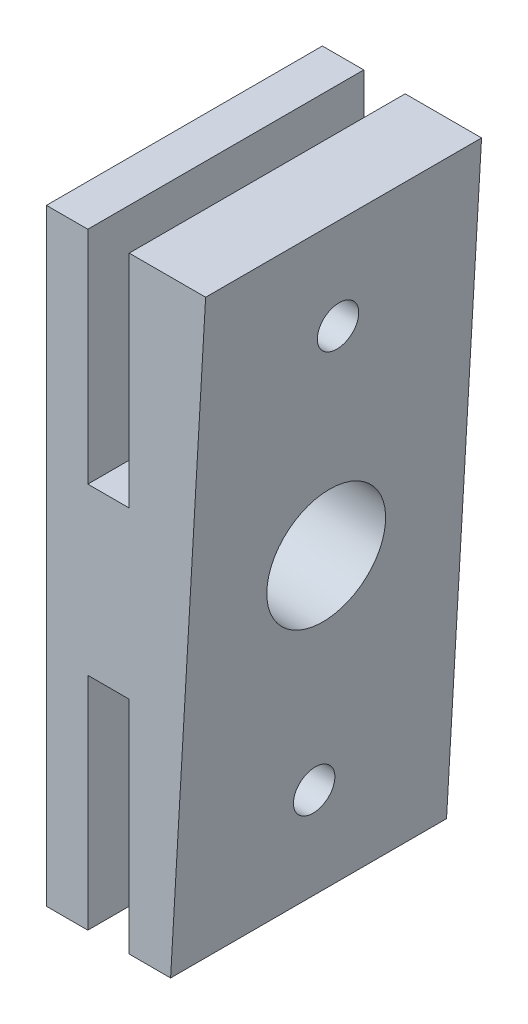
ISO-10303-21;
HEADER;
FILE_DESCRIPTION(('STEP AP214'),'2;1');
FILE_NAME('part.step','',(''),(''),'','','');
FILE_SCHEMA(('AUTOMOTIVE_DESIGN { 1 0 10303 214 1 1 1 1 }'));
ENDSEC;
DATA;
#1=APPLICATION_CONTEXT('core data for automotive mechanical design processes');
#2=APPLICATION_PROTOCOL_DEFINITION('international standard','automotive_design',2000,#1);
#3=PRODUCT_CONTEXT('',#1,'mechanical');
#4=PRODUCT('Part','Part','',(#3));
#5=PRODUCT_RELATED_PRODUCT_CATEGORY('part','',(#4));
#6=PRODUCT_DEFINITION_FORMATION('','',#4);
#7=PRODUCT_DEFINITION_CONTEXT('part definition',#1,'design');
#8=PRODUCT_DEFINITION('design','',#6,#7);
#9=PRODUCT_DEFINITION_SHAPE('','',#8);
#10=(LENGTH_UNIT() NAMED_UNIT(*) SI_UNIT(.MILLI.,.METRE.));
#11=(NAMED_UNIT(*) PLANE_ANGLE_UNIT() SI_UNIT($,.RADIAN.));
#12=(NAMED_UNIT(*) SI_UNIT($,.STERADIAN.) SOLID_ANGLE_UNIT());
#13=UNCERTAINTY_MEASURE_WITH_UNIT(LENGTH_MEASURE(1.E-05),#10,'distance_accuracy_value','');
#14=(GEOMETRIC_REPRESENTATION_CONTEXT(3) GLOBAL_UNCERTAINTY_ASSIGNED_CONTEXT((#13)) GLOBAL_UNIT_ASSIGNED_CONTEXT((#10,
#11,#12)) REPRESENTATION_CONTEXT('',''));
#15=CARTESIAN_POINT('',(0.,0.,0.));
#16=DIRECTION('',(0.,0.,1.));
#17=DIRECTION('',(1.,0.,0.));
#18=AXIS2_PLACEMENT_3D('',#15,#16,#17);
#19=CARTESIAN_POINT('',(3.,22.,20.));
#20=DIRECTION('',(0.,-1.,0.));
#21=DIRECTION('',(0.,0.,-1.));
#22=AXIS2_PLACEMENT_3D('',#19,#20,#21);
#23=PLANE('',#22);
#24=DIRECTION('',(-1.,0.,0.));
#25=VECTOR('',#24,1.);
#26=CARTESIAN_POINT('',(3.,22.,0.));
#27=LINE('',#26,#25);
#28=CARTESIAN_POINT('',(3.,22.,0.));
#29=VERTEX_POINT('',#28);
#30=CARTESIAN_POINT('',(0.,22.,0.));
#31=VERTEX_POINT('',#30);
#32=EDGE_CURVE('E155',#29,#31,#27,.T.);
#33=ORIENTED_EDGE('',*,*,#32,.T.);
#34=DIRECTION('',(0.,0.,-1.));
#35=VECTOR('',#34,1.);
#36=CARTESIAN_POINT('',(0.,22.,20.));
#37=LINE('',#36,#35);
#38=CARTESIAN_POINT('',(0.,22.,20.));
#39=VERTEX_POINT('',#38);
#40=EDGE_CURVE('E12',#39,#31,#37,.T.);
#41=ORIENTED_EDGE('',*,*,#40,.F.);
#42=DIRECTION('',(-1.,0.,0.));
#43=VECTOR('',#42,1.);
#44=CARTESIAN_POINT('',(3.,22.,20.));
#45=LINE('',#44,#43);
#46=CARTESIAN_POINT('',(3.,22.,20.));
#47=VERTEX_POINT('',#46);
#48=EDGE_CURVE('E177',#47,#39,#45,.T.);
#49=ORIENTED_EDGE('',*,*,#48,.F.);
#50=DIRECTION('',(0.,0.,-1.));
#51=VECTOR('',#50,1.);
#52=CARTESIAN_POINT('',(3.,22.,20.));
#53=LINE('',#52,#51);
#54=EDGE_CURVE('E151',#47,#29,#53,.T.);
#55=ORIENTED_EDGE('',*,*,#54,.T.);
#56=EDGE_LOOP('',(#33,#41,#49,#55));
#57=FACE_BOUND('',#56,.T.);
#58=ADVANCED_FACE('F36',(#57),#23,.F.);
#59=CARTESIAN_POINT('',(0.,22.,20.));
#60=DIRECTION('',(1.,0.,0.));
#61=DIRECTION('',(0.,0.,-1.));
#62=AXIS2_PLACEMENT_3D('',#59,#60,#61);
#63=PLANE('',#62);
#64=CARTESIAN_POINT('',(0.,0.749999999900975,10.));
#65=DIRECTION('',(1.,0.,0.));
#66=DIRECTION('',(0.,1.,0.));
#67=AXIS2_PLACEMENT_3D('',#64,#65,#66);
#68=ELLIPSE('',#67,4.30715012040991,4.3);
#69=CARTESIAN_POINT('',(0.,5.05715012031088,10.));
#70=VERTEX_POINT('',#69);
#71=EDGE_CURVE('E40',#70,#70,#68,.F.);
#72=ORIENTED_EDGE('',*,*,#71,.F.);
#73=EDGE_LOOP('',(#72));
#74=FACE_BOUND('',#73,.T.);
#75=CARTESIAN_POINT('',(0.,-15.,10.));
#76=DIRECTION('',(-1.,0.,0.));
#77=DIRECTION('',(0.,0.,1.));
#78=AXIS2_PLACEMENT_3D('',#75,#76,#77);
#79=CIRCLE('',#78,1.5);
#80=CARTESIAN_POINT('',(0.,-15.,11.5));
#81=VERTEX_POINT('',#80);
#82=EDGE_CURVE('E206',#81,#81,#79,.T.);
#83=ORIENTED_EDGE('',*,*,#82,.F.);
#84=EDGE_LOOP('',(#83));
#85=FACE_BOUND('',#84,.T.);
#86=CARTESIAN_POINT('',(0.,15.,10.));
#87=DIRECTION('',(-1.,0.,0.));
#88=DIRECTION('',(0.,0.,1.));
#89=AXIS2_PLACEMENT_3D('',#86,#87,#88);
#90=CIRCLE('',#89,1.5);
#91=CARTESIAN_POINT('',(0.,15.,11.5));
#92=VERTEX_POINT('',#91);
#93=EDGE_CURVE('E202',#92,#92,#90,.T.);
#94=ORIENTED_EDGE('',*,*,#93,.F.);
#95=EDGE_LOOP('',(#94));
#96=FACE_BOUND('',#95,.T.);
#97=DIRECTION('',(0.,-1.,0.));
#98=VECTOR('',#97,1.);
#99=CARTESIAN_POINT('',(0.,22.,0.));
#100=LINE('',#99,#98);
#101=CARTESIAN_POINT('',(0.,-22.,0.));
#102=VERTEX_POINT('',#101);
#103=EDGE_CURVE('E158',#31,#102,#100,.T.);
#104=ORIENTED_EDGE('',*,*,#103,.T.);
#105=DIRECTION('',(0.,0.,-1.));
#106=VECTOR('',#105,1.);
#107=CARTESIAN_POINT('',(0.,-22.,20.));
#108=LINE('',#107,#106);
#109=CARTESIAN_POINT('',(0.,-22.,20.));
#110=VERTEX_POINT('',#109);
#111=EDGE_CURVE('E46',#110,#102,#108,.T.);
#112=ORIENTED_EDGE('',*,*,#111,.F.);
#113=DIRECTION('',(0.,-1.,0.));
#114=VECTOR('',#113,1.);
#115=CARTESIAN_POINT('',(0.,22.,20.));
#116=LINE('',#115,#114);
#117=EDGE_CURVE('E105',#39,#110,#116,.T.);
#118=ORIENTED_EDGE('',*,*,#117,.F.);
#119=ORIENTED_EDGE('',*,*,#40,.T.);
#120=EDGE_LOOP('',(#104,#112,#118,#119));
#121=FACE_BOUND('',#120,.T.);
#122=ADVANCED_FACE('F217',(#74,#85,#96,#121),#63,.F.);
#123=CARTESIAN_POINT('',(0.,-22.,20.));
#124=DIRECTION('',(0.,1.,0.));
#125=DIRECTION('',(0.,0.,1.));
#126=AXIS2_PLACEMENT_3D('',#123,#124,#125);
#127=PLANE('',#126);
#128=DIRECTION('',(1.,0.,0.));
#129=VECTOR('',#128,1.);
#130=CARTESIAN_POINT('',(0.,-22.,0.));
#131=LINE('',#130,#129);
#132=CARTESIAN_POINT('',(3.,-22.,0.));
#133=VERTEX_POINT('',#132);
#134=EDGE_CURVE('E161',#102,#133,#131,.T.);
#135=ORIENTED_EDGE('',*,*,#134,.T.);
#136=DIRECTION('',(0.,0.,-1.));
#137=VECTOR('',#136,1.);
#138=CARTESIAN_POINT('',(3.,-22.,20.));
#139=LINE('',#138,#137);
#140=CARTESIAN_POINT('',(3.,-22.,20.));
#141=VERTEX_POINT('',#140);
#142=EDGE_CURVE('E193',#141,#133,#139,.T.);
#143=ORIENTED_EDGE('',*,*,#142,.F.);
#144=DIRECTION('',(1.,0.,0.));
#145=VECTOR('',#144,1.);
#146=CARTESIAN_POINT('',(0.,-22.,20.));
#147=LINE('',#146,#145);
#148=EDGE_CURVE('E233',#110,#141,#147,.T.);
#149=ORIENTED_EDGE('',*,*,#148,.F.);
#150=ORIENTED_EDGE('',*,*,#111,.T.);
#151=EDGE_LOOP('',(#135,#143,#149,#150));
#152=FACE_BOUND('',#151,.T.);
#153=ADVANCED_FACE('F220',(#152),#127,.F.);
#154=CARTESIAN_POINT('',(3.,-22.,20.));
#155=DIRECTION('',(-1.,0.,0.));
#156=DIRECTION('',(0.,0.,1.));
#157=AXIS2_PLACEMENT_3D('',#154,#155,#156);
#158=PLANE('',#157);
#159=CARTESIAN_POINT('',(3.,-15.,10.));
#160=DIRECTION('',(-1.,0.,0.));
#161=DIRECTION('',(0.,0.,1.));
#162=AXIS2_PLACEMENT_3D('',#159,#160,#161);
#163=CIRCLE('',#162,1.5);
#164=CARTESIAN_POINT('',(3.,-15.,11.5));
#165=VERTEX_POINT('',#164);
#166=EDGE_CURVE('E291',#165,#165,#163,.T.);
#167=ORIENTED_EDGE('',*,*,#166,.T.);
#168=EDGE_LOOP('',(#167));
#169=FACE_BOUND('',#168,.T.);
#170=DIRECTION('',(0.,1.,0.));
#171=VECTOR('',#170,1.);
#172=CARTESIAN_POINT('',(3.,-22.,0.));
#173=LINE('',#172,#171);
#174=CARTESIAN_POINT('',(3.,-6.,0.));
#175=VERTEX_POINT('',#174);
#176=EDGE_CURVE('E163',#133,#175,#173,.T.);
#177=ORIENTED_EDGE('',*,*,#176,.T.);
#178=DIRECTION('',(0.,0.,-1.));
#179=VECTOR('',#178,1.);
#180=CARTESIAN_POINT('',(3.,-6.,20.));
#181=LINE('',#180,#179);
#182=CARTESIAN_POINT('',(3.,-6.,20.));
#183=VERTEX_POINT('',#182);
#184=EDGE_CURVE('E190',#183,#175,#181,.T.);
#185=ORIENTED_EDGE('',*,*,#184,.F.);
#186=DIRECTION('',(0.,1.,0.));
#187=VECTOR('',#186,1.);
#188=CARTESIAN_POINT('',(3.,-22.,20.));
#189=LINE('',#188,#187);
#190=EDGE_CURVE('E249',#141,#183,#189,.T.);
#191=ORIENTED_EDGE('',*,*,#190,.F.);
#192=ORIENTED_EDGE('',*,*,#142,.T.);
#193=EDGE_LOOP('',(#177,#185,#191,#192));
#194=FACE_BOUND('',#193,.T.);
#195=ADVANCED_FACE('F240',(#169,#194),#158,.F.);
#196=CARTESIAN_POINT('',(3.,-6.,20.));
#197=DIRECTION('',(0.,1.,0.));
#198=DIRECTION('',(0.,0.,1.));
#199=AXIS2_PLACEMENT_3D('',#196,#197,#198);
#200=PLANE('',#199);
#201=DIRECTION('',(1.,0.,0.));
#202=VECTOR('',#201,1.);
#203=CARTESIAN_POINT('',(3.,-6.,0.));
#204=LINE('',#203,#202);
#205=CARTESIAN_POINT('',(6.,-6.,0.));
#206=VERTEX_POINT('',#205);
#207=EDGE_CURVE('E165',#175,#206,#204,.T.);
#208=ORIENTED_EDGE('',*,*,#207,.T.);
#209=DIRECTION('',(0.,0.,-1.));
#210=VECTOR('',#209,1.);
#211=CARTESIAN_POINT('',(6.,-6.,20.));
#212=LINE('',#211,#210);
#213=CARTESIAN_POINT('',(6.,-6.,20.));
#214=VERTEX_POINT('',#213);
#215=EDGE_CURVE('E187',#214,#206,#212,.T.);
#216=ORIENTED_EDGE('',*,*,#215,.F.);
#217=DIRECTION('',(1.,0.,0.));
#218=VECTOR('',#217,1.);
#219=CARTESIAN_POINT('',(3.,-6.,20.));
#220=LINE('',#219,#218);
#221=EDGE_CURVE('E246',#183,#214,#220,.T.);
#222=ORIENTED_EDGE('',*,*,#221,.F.);
#223=ORIENTED_EDGE('',*,*,#184,.T.);
#224=EDGE_LOOP('',(#208,#216,#222,#223));
#225=FACE_BOUND('',#224,.T.);
#226=ADVANCED_FACE('F244',(#225),#200,.F.);
#227=CARTESIAN_POINT('',(6.,-6.,20.));
#228=DIRECTION('',(1.,0.,0.));
#229=DIRECTION('',(0.,1.,0.));
#230=AXIS2_PLACEMENT_3D('',#227,#228,#229);
#231=PLANE('',#230);
#232=CARTESIAN_POINT('',(6.,-15.,10.));
#233=DIRECTION('',(1.,0.,0.));
#234=DIRECTION('',(0.,1.,0.));
#235=AXIS2_PLACEMENT_3D('',#232,#233,#234);
#236=CIRCLE('',#235,1.5);
#237=CARTESIAN_POINT('',(6.,-13.5,10.));
#238=VERTEX_POINT('',#237);
#239=EDGE_CURVE('E205',#238,#238,#236,.T.);
#240=ORIENTED_EDGE('',*,*,#239,.T.);
#241=EDGE_LOOP('',(#240));
#242=FACE_BOUND('',#241,.T.);
#243=DIRECTION('',(0.,-1.,0.));
#244=VECTOR('',#243,1.);
#245=CARTESIAN_POINT('',(6.,-6.,0.));
#246=LINE('',#245,#244);
#247=CARTESIAN_POINT('',(6.00000000000001,-22.,0.));
#248=VERTEX_POINT('',#247);
#249=EDGE_CURVE('E167',#206,#248,#246,.T.);
#250=ORIENTED_EDGE('',*,*,#249,.T.);
#251=DIRECTION('',(0.,0.,-1.));
#252=VECTOR('',#251,1.);
#253=CARTESIAN_POINT('',(6.00000000000001,-22.,20.));
#254=LINE('',#253,#252);
#255=CARTESIAN_POINT('',(6.00000000000001,-22.,20.));
#256=VERTEX_POINT('',#255);
#257=EDGE_CURVE('E184',#256,#248,#254,.T.);
#258=ORIENTED_EDGE('',*,*,#257,.F.);
#259=DIRECTION('',(0.,-1.,0.));
#260=VECTOR('',#259,1.);
#261=CARTESIAN_POINT('',(6.,-6.,20.));
#262=LINE('',#261,#260);
#263=EDGE_CURVE('E248',#214,#256,#262,.T.);
#264=ORIENTED_EDGE('',*,*,#263,.F.);
#265=ORIENTED_EDGE('',*,*,#215,.T.);
#266=EDGE_LOOP('',(#250,#258,#264,#265));
#267=FACE_BOUND('',#266,.T.);
#268=ADVANCED_FACE('F297',(#242,#267),#231,.F.);
#269=CARTESIAN_POINT('',(6.00000000000001,-22.,20.));
#270=DIRECTION('',(0.,1.,0.));
#271=DIRECTION('',(-1.,0.,0.));
#272=AXIS2_PLACEMENT_3D('',#269,#270,#271);
#273=PLANE('',#272);
#274=DIRECTION('',(1.,0.,0.));
#275=VECTOR('',#274,1.);
#276=CARTESIAN_POINT('',(6.00000000000001,-22.,0.));
#277=LINE('',#276,#275);
#278=CARTESIAN_POINT('',(9.00000000000001,-22.,0.));
#279=VERTEX_POINT('',#278);
#280=EDGE_CURVE('E169',#248,#279,#277,.T.);
#281=ORIENTED_EDGE('',*,*,#280,.T.);
#282=DIRECTION('',(0.,0.,-1.));
#283=VECTOR('',#282,1.);
#284=CARTESIAN_POINT('',(9.00000000000001,-22.,20.));
#285=LINE('',#284,#283);
#286=CARTESIAN_POINT('',(9.00000000000001,-22.,20.));
#287=VERTEX_POINT('',#286);
#288=EDGE_CURVE('E181',#287,#279,#285,.T.);
#289=ORIENTED_EDGE('',*,*,#288,.F.);
#290=DIRECTION('',(1.,0.,0.));
#291=VECTOR('',#290,1.);
#292=CARTESIAN_POINT('',(6.00000000000001,-22.,20.));
#293=LINE('',#292,#291);
#294=EDGE_CURVE('E251',#256,#287,#293,.T.);
#295=ORIENTED_EDGE('',*,*,#294,.F.);
#296=ORIENTED_EDGE('',*,*,#257,.T.);
#297=EDGE_LOOP('',(#281,#289,#295,#296));
#298=FACE_BOUND('',#297,.T.);
#299=ADVANCED_FACE('F263',(#298),#273,.F.);
#300=CARTESIAN_POINT('',(9.00000000000001,22.,20.));
#301=DIRECTION('',(0.,-1.,0.));
#302=DIRECTION('',(1.,0.,0.));
#303=AXIS2_PLACEMENT_3D('',#300,#301,#302);
#304=PLANE('',#303);
#305=DIRECTION('',(-1.,0.,0.));
#306=VECTOR('',#305,1.);
#307=CARTESIAN_POINT('',(9.00000000000001,22.,0.));
#308=LINE('',#307,#306);
#309=CARTESIAN_POINT('',(11.5384615381261,22.,0.));
#310=VERTEX_POINT('',#309);
#311=CARTESIAN_POINT('',(6.00000000000001,22.,0.));
#312=VERTEX_POINT('',#311);
#313=EDGE_CURVE('E172',#310,#312,#308,.T.);
#314=ORIENTED_EDGE('',*,*,#313,.T.);
#315=DIRECTION('',(0.,0.,-1.));
#316=VECTOR('',#315,1.);
#317=CARTESIAN_POINT('',(6.00000000000001,22.,20.));
#318=LINE('',#317,#316);
#319=CARTESIAN_POINT('',(6.00000000000001,22.,20.));
#320=VERTEX_POINT('',#319);
#321=EDGE_CURVE('E146',#320,#312,#318,.T.);
#322=ORIENTED_EDGE('',*,*,#321,.F.);
#323=DIRECTION('',(-1.,0.,0.));
#324=VECTOR('',#323,1.);
#325=CARTESIAN_POINT('',(9.00000000000001,22.,20.));
#326=LINE('',#325,#324);
#327=CARTESIAN_POINT('',(11.5384615381261,22.,20.));
#328=VERTEX_POINT('',#327);
#329=EDGE_CURVE('E137',#328,#320,#326,.T.);
#330=ORIENTED_EDGE('',*,*,#329,.F.);
#331=DIRECTION('',(0.,0.,-1.));
#332=VECTOR('',#331,1.);
#333=CARTESIAN_POINT('',(11.5384615381261,22.,64.073164022799));
#334=LINE('',#333,#332);
#335=EDGE_CURVE('E270',#328,#310,#334,.T.);
#336=ORIENTED_EDGE('',*,*,#335,.T.);
#337=EDGE_LOOP('',(#314,#322,#330,#336));
#338=FACE_BOUND('',#337,.T.);
#339=ADVANCED_FACE('F282',(#338),#304,.F.);
#340=CARTESIAN_POINT('',(6.00000000000001,22.,20.));
#341=DIRECTION('',(1.,0.,0.));
#342=DIRECTION('',(0.,1.,0.));
#343=AXIS2_PLACEMENT_3D('',#340,#341,#342);
#344=PLANE('',#343);
#345=CARTESIAN_POINT('',(6.,15.,10.));
#346=DIRECTION('',(1.,0.,0.));
#347=DIRECTION('',(0.,1.,0.));
#348=AXIS2_PLACEMENT_3D('',#345,#346,#347);
#349=CIRCLE('',#348,1.5);
#350=CARTESIAN_POINT('',(6.,16.5,10.));
#351=VERTEX_POINT('',#350);
#352=EDGE_CURVE('E283',#351,#351,#349,.T.);
#353=ORIENTED_EDGE('',*,*,#352,.T.);
#354=EDGE_LOOP('',(#353));
#355=FACE_BOUND('',#354,.T.);
#356=DIRECTION('',(0.,-1.,0.));
#357=VECTOR('',#356,1.);
#358=CARTESIAN_POINT('',(6.00000000000001,22.,0.));
#359=LINE('',#358,#357);
#360=CARTESIAN_POINT('',(6.,6.,0.));
#361=VERTEX_POINT('',#360);
#362=EDGE_CURVE('E145',#312,#361,#359,.T.);
#363=ORIENTED_EDGE('',*,*,#362,.T.);
#364=DIRECTION('',(0.,0.,-1.));
#365=VECTOR('',#364,1.);
#366=CARTESIAN_POINT('',(6.,6.,20.));
#367=LINE('',#366,#365);
#368=CARTESIAN_POINT('',(6.,6.,20.));
#369=VERTEX_POINT('',#368);
#370=EDGE_CURVE('E142',#369,#361,#367,.T.);
#371=ORIENTED_EDGE('',*,*,#370,.F.);
#372=DIRECTION('',(0.,-1.,0.));
#373=VECTOR('',#372,1.);
#374=CARTESIAN_POINT('',(6.00000000000001,22.,20.));
#375=LINE('',#374,#373);
#376=EDGE_CURVE('E130',#320,#369,#375,.T.);
#377=ORIENTED_EDGE('',*,*,#376,.F.);
#378=ORIENTED_EDGE('',*,*,#321,.T.);
#379=EDGE_LOOP('',(#363,#371,#377,#378));
#380=FACE_BOUND('',#379,.T.);
#381=ADVANCED_FACE('F143',(#355,#380),#344,.F.);
#382=CARTESIAN_POINT('',(6.,6.,20.));
#383=DIRECTION('',(0.,-1.,0.));
#384=DIRECTION('',(1.,0.,0.));
#385=AXIS2_PLACEMENT_3D('',#382,#383,#384);
#386=PLANE('',#385);
#387=DIRECTION('',(-1.,0.,0.));
#388=VECTOR('',#387,1.);
#389=CARTESIAN_POINT('',(6.,6.,0.));
#390=LINE('',#389,#388);
#391=CARTESIAN_POINT('',(3.,6.,0.));
#392=VERTEX_POINT('',#391);
#393=EDGE_CURVE('E91',#361,#392,#390,.T.);
#394=ORIENTED_EDGE('',*,*,#393,.T.);
#395=DIRECTION('',(0.,0.,-1.));
#396=VECTOR('',#395,1.);
#397=CARTESIAN_POINT('',(3.,6.,20.));
#398=LINE('',#397,#396);
#399=CARTESIAN_POINT('',(3.,6.,20.));
#400=VERTEX_POINT('',#399);
#401=EDGE_CURVE('E147',#400,#392,#398,.T.);
#402=ORIENTED_EDGE('',*,*,#401,.F.);
#403=DIRECTION('',(-1.,0.,0.));
#404=VECTOR('',#403,1.);
#405=CARTESIAN_POINT('',(6.,6.,20.));
#406=LINE('',#405,#404);
#407=EDGE_CURVE('E134',#369,#400,#406,.T.);
#408=ORIENTED_EDGE('',*,*,#407,.F.);
#409=ORIENTED_EDGE('',*,*,#370,.T.);
#410=EDGE_LOOP('',(#394,#402,#408,#409));
#411=FACE_BOUND('',#410,.T.);
#412=ADVANCED_FACE('F149',(#411),#386,.F.);
#413=CARTESIAN_POINT('',(3.,6.,20.));
#414=DIRECTION('',(-1.,0.,0.));
#415=DIRECTION('',(0.,0.,1.));
#416=AXIS2_PLACEMENT_3D('',#413,#414,#415);
#417=PLANE('',#416);
#418=CARTESIAN_POINT('',(3.,15.,10.));
#419=DIRECTION('',(-1.,0.,0.));
#420=DIRECTION('',(0.,0.,1.));
#421=AXIS2_PLACEMENT_3D('',#418,#419,#420);
#422=CIRCLE('',#421,1.5);
#423=CARTESIAN_POINT('',(3.,15.,11.5));
#424=VERTEX_POINT('',#423);
#425=EDGE_CURVE('E201',#424,#424,#422,.T.);
#426=ORIENTED_EDGE('',*,*,#425,.T.);
#427=EDGE_LOOP('',(#426));
#428=FACE_BOUND('',#427,.T.);
#429=DIRECTION('',(0.,1.,0.));
#430=VECTOR('',#429,1.);
#431=CARTESIAN_POINT('',(3.,6.,0.));
#432=LINE('',#431,#430);
#433=EDGE_CURVE('E97',#392,#29,#432,.T.);
#434=ORIENTED_EDGE('',*,*,#433,.T.);
#435=ORIENTED_EDGE('',*,*,#54,.F.);
#436=DIRECTION('',(0.,1.,0.));
#437=VECTOR('',#436,1.);
#438=CARTESIAN_POINT('',(3.,6.,20.));
#439=LINE('',#438,#437);
#440=EDGE_CURVE('E55',#400,#47,#439,.T.);
#441=ORIENTED_EDGE('',*,*,#440,.F.);
#442=ORIENTED_EDGE('',*,*,#401,.T.);
#443=EDGE_LOOP('',(#434,#435,#441,#442));
#444=FACE_BOUND('',#443,.T.);
#445=ADVANCED_FACE('F335',(#428,#444),#417,.F.);
#446=CARTESIAN_POINT('',(0.,0.,20.));
#447=DIRECTION('',(0.,0.,1.));
#448=DIRECTION('',(1.,0.,0.));
#449=AXIS2_PLACEMENT_3D('',#446,#447,#448);
#450=PLANE('',#449);
#451=ORIENTED_EDGE('',*,*,#48,.T.);
#452=ORIENTED_EDGE('',*,*,#117,.T.);
#453=ORIENTED_EDGE('',*,*,#148,.T.);
#454=ORIENTED_EDGE('',*,*,#190,.T.);
#455=ORIENTED_EDGE('',*,*,#221,.T.);
#456=ORIENTED_EDGE('',*,*,#263,.T.);
#457=ORIENTED_EDGE('',*,*,#294,.T.);
#458=DIRECTION('',(-0.0575965350890834,-0.998339941676047,0.));
#459=VECTOR('',#458,1.);
#460=CARTESIAN_POINT('',(11.5384615381261,22.,20.));
#461=LINE('',#460,#459);
#462=EDGE_CURVE('E159',#328,#287,#461,.T.);
#463=ORIENTED_EDGE('',*,*,#462,.F.);
#464=ORIENTED_EDGE('',*,*,#329,.T.);
#465=ORIENTED_EDGE('',*,*,#376,.T.);
#466=ORIENTED_EDGE('',*,*,#407,.T.);
#467=ORIENTED_EDGE('',*,*,#440,.T.);
#468=EDGE_LOOP('',(#451,#452,#453,#454,#455,#456,#457,#463,#464,#465,#466,#467));
#469=FACE_BOUND('',#468,.T.);
#470=ADVANCED_FACE('F132',(#469),#450,.T.);
#471=CARTESIAN_POINT('',(0.,0.,0.));
#472=DIRECTION('',(0.,0.,1.));
#473=DIRECTION('',(1.,0.,0.));
#474=AXIS2_PLACEMENT_3D('',#471,#472,#473);
#475=PLANE('',#474);
#476=ORIENTED_EDGE('',*,*,#32,.F.);
#477=ORIENTED_EDGE('',*,*,#433,.F.);
#478=ORIENTED_EDGE('',*,*,#393,.F.);
#479=ORIENTED_EDGE('',*,*,#362,.F.);
#480=ORIENTED_EDGE('',*,*,#313,.F.);
#481=DIRECTION('',(-0.0575965350890834,-0.998339941676047,0.));
#482=VECTOR('',#481,1.);
#483=CARTESIAN_POINT('',(11.5384615381261,22.,0.));
#484=LINE('',#483,#482);
#485=EDGE_CURVE('E272',#310,#279,#484,.T.);
#486=ORIENTED_EDGE('',*,*,#485,.T.);
#487=ORIENTED_EDGE('',*,*,#280,.F.);
#488=ORIENTED_EDGE('',*,*,#249,.F.);
#489=ORIENTED_EDGE('',*,*,#207,.F.);
#490=ORIENTED_EDGE('',*,*,#176,.F.);
#491=ORIENTED_EDGE('',*,*,#134,.F.);
#492=ORIENTED_EDGE('',*,*,#103,.F.);
#493=EDGE_LOOP('',(#476,#477,#478,#479,#480,#486,#487,#488,#489,#490,#491,#492));
#494=FACE_BOUND('',#493,.T.);
#495=ADVANCED_FACE('F235',(#494),#475,.F.);
#496=CARTESIAN_POINT('',(11.5384615381261,22.,64.073164022799));
#497=DIRECTION('',(0.998339941676046,-0.0575965350890834,0.));
#498=DIRECTION('',(0.0575965350890834,0.998339941676047,0.));
#499=AXIS2_PLACEMENT_3D('',#496,#497,#498);
#500=PLANE('',#499);
#501=CARTESIAN_POINT('',(10.2782897160118,0.157021747132434,10.));
#502=DIRECTION('',(0.998339941676046,-0.0575965350890834,0.));
#503=DIRECTION('',(0.0575965350890834,0.998339941676047,0.));
#504=AXIS2_PLACEMENT_3D('',#501,#502,#503);
#505=CIRCLE('',#504,4.3);
#506=CARTESIAN_POINT('',(10.5259548168948,4.44988349633944,10.));
#507=VERTEX_POINT('',#506);
#508=EDGE_CURVE('E207',#507,#507,#505,.T.);
#509=ORIENTED_EDGE('',*,*,#508,.F.);
#510=EDGE_LOOP('',(#509));
#511=FACE_BOUND('',#510,.T.);
#512=CARTESIAN_POINT('',(9.40384615379279,-15.,10.));
#513=DIRECTION('',(0.998339941676046,-0.0575965350890834,0.));
#514=DIRECTION('',(-0.0575965350890834,-0.998339941676047,0.));
#515=AXIS2_PLACEMENT_3D('',#512,#513,#514);
#516=ELLIPSE('',#515,1.50249422804997,1.5);
#517=CARTESIAN_POINT('',(9.31730769226576,-16.5,10.));
#518=VERTEX_POINT('',#517);
#519=EDGE_CURVE('E203',#518,#518,#516,.T.);
#520=ORIENTED_EDGE('',*,*,#519,.F.);
#521=EDGE_LOOP('',(#520));
#522=FACE_BOUND('',#521,.T.);
#523=CARTESIAN_POINT('',(11.1346153843333,15.,10.));
#524=DIRECTION('',(0.998339941676046,-0.0575965350890834,0.));
#525=DIRECTION('',(-0.0575965350890834,-0.998339941676047,0.));
#526=AXIS2_PLACEMENT_3D('',#523,#524,#525);
#527=ELLIPSE('',#526,1.50249422804997,1.5);
#528=CARTESIAN_POINT('',(11.0480769228063,13.5,10.));
#529=VERTEX_POINT('',#528);
#530=EDGE_CURVE('E198',#529,#529,#527,.T.);
#531=ORIENTED_EDGE('',*,*,#530,.F.);
#532=EDGE_LOOP('',(#531));
#533=FACE_BOUND('',#532,.T.);
#534=ORIENTED_EDGE('',*,*,#335,.F.);
#535=ORIENTED_EDGE('',*,*,#462,.T.);
#536=ORIENTED_EDGE('',*,*,#288,.T.);
#537=ORIENTED_EDGE('',*,*,#485,.F.);
#538=EDGE_LOOP('',(#534,#535,#536,#537));
#539=FACE_BOUND('',#538,.T.);
#540=ADVANCED_FACE('F268',(#511,#522,#533,#539),#500,.T.);
#541=CARTESIAN_POINT('',(11.5384615381261,15.,10.));
#542=DIRECTION('',(-1.,0.,0.));
#543=DIRECTION('',(0.,0.,1.));
#544=AXIS2_PLACEMENT_3D('',#541,#542,#543);
#545=CYLINDRICAL_SURFACE('',#544,1.5);
#546=ORIENTED_EDGE('',*,*,#530,.T.);
#547=EDGE_LOOP('',(#546));
#548=FACE_BOUND('',#547,.T.);
#549=ORIENTED_EDGE('',*,*,#352,.F.);
#550=EDGE_LOOP('',(#549));
#551=FACE_BOUND('',#550,.T.);
#552=ADVANCED_FACE('F311',(#548,#551),#545,.F.);
#553=ORIENTED_EDGE('',*,*,#93,.T.);
#554=EDGE_LOOP('',(#553));
#555=FACE_BOUND('',#554,.T.);
#556=ORIENTED_EDGE('',*,*,#425,.F.);
#557=EDGE_LOOP('',(#556));
#558=FACE_BOUND('',#557,.T.);
#559=ADVANCED_FACE('F303',(#555,#558),#545,.F.);
#560=CARTESIAN_POINT('',(11.5384615381261,-15.,10.));
#561=DIRECTION('',(-1.,0.,0.));
#562=DIRECTION('',(0.,0.,1.));
#563=AXIS2_PLACEMENT_3D('',#560,#561,#562);
#564=CYLINDRICAL_SURFACE('',#563,1.5);
#565=ORIENTED_EDGE('',*,*,#519,.T.);
#566=EDGE_LOOP('',(#565));
#567=FACE_BOUND('',#566,.T.);
#568=ORIENTED_EDGE('',*,*,#239,.F.);
#569=EDGE_LOOP('',(#568));
#570=FACE_BOUND('',#569,.T.);
#571=ADVANCED_FACE('F300',(#567,#570),#564,.F.);
#572=ORIENTED_EDGE('',*,*,#82,.T.);
#573=EDGE_LOOP('',(#572));
#574=FACE_BOUND('',#573,.T.);
#575=ORIENTED_EDGE('',*,*,#166,.F.);
#576=EDGE_LOOP('',(#575));
#577=FACE_BOUND('',#576,.T.);
#578=ADVANCED_FACE('F302',(#574,#577),#564,.F.);
#579=CARTESIAN_POINT('',(11.5408877772155,0.084179551303377,10.));
#580=DIRECTION('',(-0.998339941676046,0.0575965350890902,0.));
#581=DIRECTION('',(0.,0.,1.));
#582=AXIS2_PLACEMENT_3D('',#579,#580,#581);
#583=CYLINDRICAL_SURFACE('',#582,4.3);
#584=ORIENTED_EDGE('',*,*,#508,.T.);
#585=EDGE_LOOP('',(#584));
#586=FACE_BOUND('',#585,.T.);
#587=ORIENTED_EDGE('',*,*,#71,.T.);
#588=EDGE_LOOP('',(#587));
#589=FACE_BOUND('',#588,.T.);
#590=ADVANCED_FACE('F38',(#586,#589),#583,.F.);
#591=CLOSED_SHELL('',(#58,#122,#153,#195,#226,#268,#299,#339,#381,#412,#445,#470,#495,#540,#552,
#559,#571,#578,#590));
#592=MANIFOLD_SOLID_BREP('B2',#591);
#593=ADVANCED_BREP_SHAPE_REPRESENTATION('',(#18,#592),#14);
#594=SHAPE_DEFINITION_REPRESENTATION(#9,#593);
ENDSEC;
END-ISO-10303-21;
